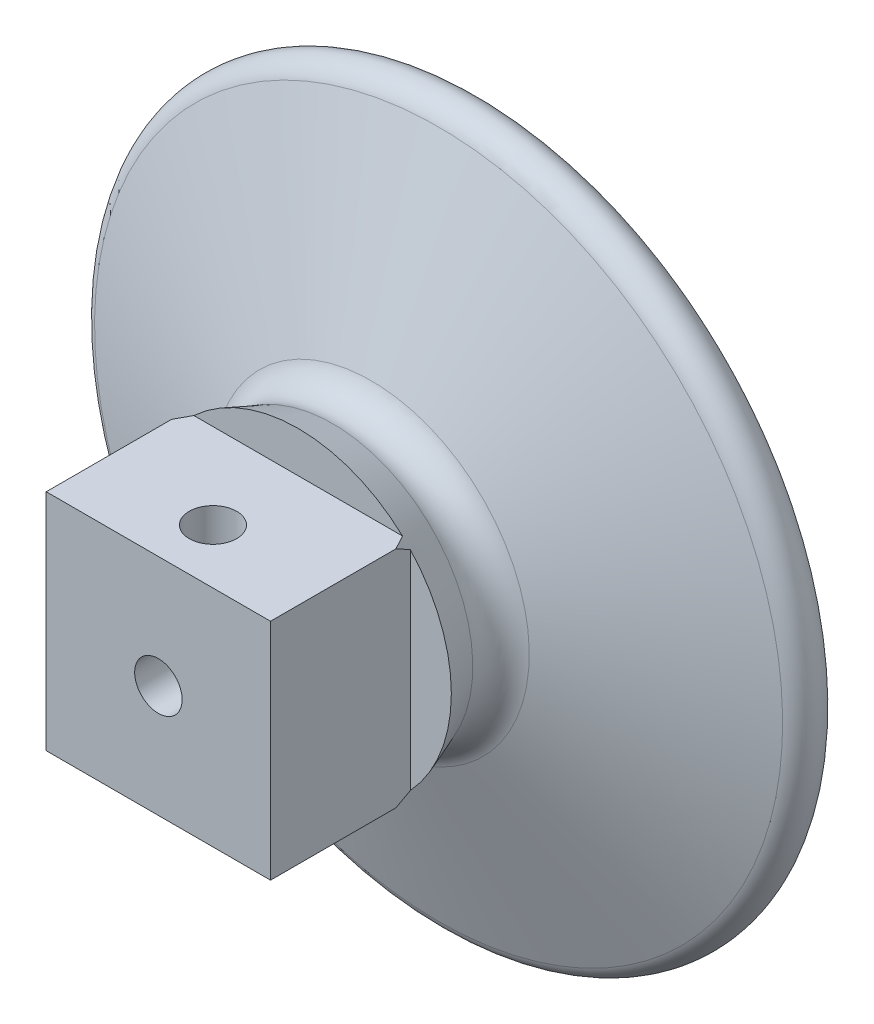
ISO-10303-21;
HEADER;
FILE_DESCRIPTION(('STEP AP214'),'2;1');
FILE_NAME('part.step','',(''),(''),'','','');
FILE_SCHEMA(('AUTOMOTIVE_DESIGN { 1 0 10303 214 1 1 1 1 }'));
ENDSEC;
DATA;
#1=APPLICATION_CONTEXT('core data for automotive mechanical design processes');
#2=APPLICATION_PROTOCOL_DEFINITION('international standard','automotive_design',2000,#1);
#3=PRODUCT_CONTEXT('',#1,'mechanical');
#4=PRODUCT('Part','Part','',(#3));
#5=PRODUCT_RELATED_PRODUCT_CATEGORY('part','',(#4));
#6=PRODUCT_DEFINITION_FORMATION('','',#4);
#7=PRODUCT_DEFINITION_CONTEXT('part definition',#1,'design');
#8=PRODUCT_DEFINITION('design','',#6,#7);
#9=PRODUCT_DEFINITION_SHAPE('','',#8);
#10=(LENGTH_UNIT() NAMED_UNIT(*) SI_UNIT(.MILLI.,.METRE.));
#11=(NAMED_UNIT(*) PLANE_ANGLE_UNIT() SI_UNIT($,.RADIAN.));
#12=(NAMED_UNIT(*) SI_UNIT($,.STERADIAN.) SOLID_ANGLE_UNIT());
#13=UNCERTAINTY_MEASURE_WITH_UNIT(LENGTH_MEASURE(1.E-05),#10,'distance_accuracy_value','');
#14=(GEOMETRIC_REPRESENTATION_CONTEXT(3) GLOBAL_UNCERTAINTY_ASSIGNED_CONTEXT((#13)) GLOBAL_UNIT_ASSIGNED_CONTEXT((#10,
#11,#12)) REPRESENTATION_CONTEXT('',''));
#15=CARTESIAN_POINT('',(0.,0.,0.));
#16=DIRECTION('',(0.,0.,1.));
#17=DIRECTION('',(1.,0.,0.));
#18=AXIS2_PLACEMENT_3D('',#15,#16,#17);
#19=CARTESIAN_POINT('',(0.,0.,-8.));
#20=DIRECTION('',(0.,0.,1.));
#21=DIRECTION('',(0.,-1.,0.));
#22=AXIS2_PLACEMENT_3D('',#19,#20,#21);
#23=CONICAL_SURFACE('',#22,9.37804492160091,0.359770803264741);
#24=CARTESIAN_POINT('',(0.,0.,-8.));
#25=DIRECTION('',(0.,0.,1.));
#26=DIRECTION('',(0.,-1.,0.));
#27=AXIS2_PLACEMENT_3D('',#24,#25,#26);
#28=CIRCLE('',#27,9.37804492160091);
#29=CARTESIAN_POINT('',(0.,-9.37804492160091,-8.));
#30=VERTEX_POINT('',#29);
#31=EDGE_CURVE('E224',#30,#30,#28,.T.);
#32=ORIENTED_EDGE('',*,*,#31,.T.);
#33=EDGE_LOOP('',(#32));
#34=FACE_BOUND('',#33,.T.);
#35=CARTESIAN_POINT('',(-7.5,7.5007,-4.73247236443383));
#36=CARTESIAN_POINT('',(-7.5,7.35811362437048,-5.00047216604525));
#37=CARTESIAN_POINT('',(-7.5,7.21398654034621,-5.26766417626513));
#38=CARTESIAN_POINT('',(-7.5,6.92200385101639,-5.80008392290339));
#39=CARTESIAN_POINT('',(-7.5,6.77414736640256,-6.06531117664168));
#40=CARTESIAN_POINT('',(-7.5,6.47252966357667,-6.59613428710672));
#41=CARTESIAN_POINT('',(-7.5,6.31872235246203,-6.86170402933926));
#42=CARTESIAN_POINT('',(-7.5,6.00587997062722,-7.38971035503824));
#43=CARTESIAN_POINT('',(-7.5,5.84684554563505,-7.65214732009066));
#44=CARTESIAN_POINT('',(-7.5,5.49732541240944,-8.21345445131997));
#45=CARTESIAN_POINT('',(-7.5,5.30578421006619,-8.511670107094));
#46=CARTESIAN_POINT('',(-7.5,4.91205806491231,-9.10099874614034));
#47=CARTESIAN_POINT('',(-7.5,4.7098748719302,-9.3921128856435));
#48=CARTESIAN_POINT('',(-7.5,4.39667523653696,-9.82054062829603));
#49=CARTESIAN_POINT('',(-7.5,4.29087114787307,-9.9616666249782));
#50=CARTESIAN_POINT('',(-7.5,4.07529306550103,-10.2408461306071));
#51=CARTESIAN_POINT('',(-7.5,3.96551942746727,-10.3788999130446));
#52=CARTESIAN_POINT('',(-7.5,3.74146253933859,-10.6511224468987));
#53=CARTESIAN_POINT('',(-7.5,3.62718301533615,-10.7852942556166));
#54=CARTESIAN_POINT('',(-7.5,3.39329082210422,-11.0488871001384));
#55=CARTESIAN_POINT('',(-7.5,3.27367938734298,-11.1783092230891));
#56=CARTESIAN_POINT('',(-7.5,3.08119708867093,-11.3765131936788));
#57=CARTESIAN_POINT('',(-7.5,3.01044276784076,-11.4473509281394));
#58=CARTESIAN_POINT('',(-7.5,2.86672039097803,-11.5867419380933));
#59=CARTESIAN_POINT('',(-7.5,2.79375229640325,-11.6552951737694));
#60=CARTESIAN_POINT('',(-7.5,2.57107184076625,-11.8571195834076));
#61=CARTESIAN_POINT('',(-7.5,2.41769852055109,-11.9864349459963));
#62=CARTESIAN_POINT('',(-7.5,2.10283920199915,-12.2278115605742));
#63=CARTESIAN_POINT('',(-7.5,1.94158910798017,-12.3401764099889));
#64=CARTESIAN_POINT('',(-7.5,1.60702225053234,-12.5449161333424));
#65=CARTESIAN_POINT('',(-7.5,1.43373207475942,-12.6373333118018));
#66=CARTESIAN_POINT('',(-7.5,1.09330367705751,-12.7865928430812));
#67=CARTESIAN_POINT('',(-7.5,0.927370824246037,-12.8461192763854));
#68=CARTESIAN_POINT('',(-7.5,0.587781906709609,-12.9368055269062));
#69=CARTESIAN_POINT('',(-7.5,0.414131398150886,-12.9679854154614));
#70=CARTESIAN_POINT('',(-7.5,0.0629699011393333,-12.9976981954961));
#71=CARTESIAN_POINT('',(-7.5,-0.11455713682984,-12.996049400716));
#72=CARTESIAN_POINT('',(-7.5,-0.466285566453067,-12.9599141384915));
#73=CARTESIAN_POINT('',(-7.5,-0.640482854630306,-12.9253895214226));
#74=CARTESIAN_POINT('',(-7.5,-1.01836905902207,-12.8174671299713));
#75=CARTESIAN_POINT('',(-7.5,-1.22002929794652,-12.7371456163215));
#76=CARTESIAN_POINT('',(-7.5,-1.60824594383761,-12.5460184094595));
#77=CARTESIAN_POINT('',(-7.5,-1.79476660566444,-12.4351431411073));
#78=CARTESIAN_POINT('',(-7.5,-2.1427493153764,-12.1996485621415));
#79=CARTESIAN_POINT('',(-7.5,-2.30504042811212,-12.0762250979694));
#80=CARTESIAN_POINT('',(-7.5,-2.61874316725789,-11.8161240235588));
#81=CARTESIAN_POINT('',(-7.5,-2.77014365923342,-11.6794331750492));
#82=CARTESIAN_POINT('',(-7.5,-3.06485571199536,-11.395425903411));
#83=CARTESIAN_POINT('',(-7.5,-3.20809340811013,-11.2480336552035));
#84=CARTESIAN_POINT('',(-7.5,-3.48667434948826,-10.9461662985553));
#85=CARTESIAN_POINT('',(-7.5,-3.6220215650345,-10.7916948233194));
#86=CARTESIAN_POINT('',(-7.5,-3.94704121898384,-10.4049446046214));
#87=CARTESIAN_POINT('',(-7.5,-4.13303620833662,-10.169585953979));
#88=CARTESIAN_POINT('',(-7.5,-4.49429038427141,-9.69072494148843));
#89=CARTESIAN_POINT('',(-7.5,-4.6695455363535,-9.44721957172711));
#90=CARTESIAN_POINT('',(-7.5,-5.01181225553217,-8.95378198380803));
#91=CARTESIAN_POINT('',(-7.5,-5.17880646398954,-8.70383778219286));
#92=CARTESIAN_POINT('',(-7.5,-5.50582658857605,-8.19942712954559));
#93=CARTESIAN_POINT('',(-7.5,-5.66585199289466,-7.94496034828735));
#94=CARTESIAN_POINT('',(-7.5,-5.97149422579674,-7.44663587776924));
#95=CARTESIAN_POINT('',(-7.5,-6.11741907872977,-7.20296645827329));
#96=CARTESIAN_POINT('',(-7.5,-6.40494834883637,-6.71307898125429));
#97=CARTESIAN_POINT('',(-7.5,-6.54655252725282,-6.46686078389097));
#98=CARTESIAN_POINT('',(-7.5,-6.82538105441513,-5.97357234665036));
#99=CARTESIAN_POINT('',(-7.5,-6.96262364656063,-5.72651239373626));
#100=CARTESIAN_POINT('',(-7.5,-7.23392400202752,-5.23069371771645));
#101=CARTESIAN_POINT('',(-7.5,-7.36798221047954,-4.98193523837368));
#102=CARTESIAN_POINT('',(-7.5,-7.50070000000013,-4.73247236443395));
#103=B_SPLINE_CURVE_WITH_KNOTS('',3,(#35,#36,#37,#38,#39,#40,#41,#42,#43,#44,#45,#46,#47,#48,
#49,#50,#51,#52,#53,#54,#55,#56,#57,#58,#59,#60,#61,#62,#63,#64,#65,#66,#67,#68,#69,#70,#71,#72,
#73,#74,#75,#76,#77,#78,#79,#80,#81,#82,#83,#84,#85,#86,#87,#88,#89,#90,#91,#92,#93,#94,#95,#96,
#97,#98,#99,#100,#101,#102),.UNSPECIFIED.,.F.,.F.,(4,2,2,2,2,2,2,2,2,2,2,2,2,2,2,2,2,2,2,2,2,2,
2,2,2,2,2,2,2,2,2,2,2,4),(0.,0.910720759354274,1.82165829118974,2.74228995235112,
3.66280830822179,4.72593748194272,5.78889239151147,6.31798655288526,6.84703342395035,
7.37565162210483,7.90414806145266,8.20446383825922,8.50478484662448,9.10592605841301,
9.694530155356,10.2818734158085,10.8087086947458,11.3351706462181,11.8645470416593,
12.3945384833943,13.0420847220465,13.6911178749675,14.3018824830244,14.9132629060778,
15.5295031498918,16.1454305928678,17.0449264871322,17.9447582381376,18.8464067934654,
19.748121457357,20.6001378339148,21.4522012072821,22.3000374487521,23.1477544691526),.UNSPECIFIED.);
#104=CARTESIAN_POINT('',(-7.5,-6.97656974205115,-5.7));
#105=VERTEX_POINT('',#104);
#106=CARTESIAN_POINT('',(-7.5,-7.5,-4.73378832314564));
#107=VERTEX_POINT('',#106);
#108=EDGE_CURVE('E165',#105,#107,#103,.T.);
#109=ORIENTED_EDGE('',*,*,#108,.F.);
#110=CARTESIAN_POINT('',(0.,0.,-5.7));
#111=DIRECTION('',(0.,0.,1.));
#112=DIRECTION('',(1.,0.,0.));
#113=AXIS2_PLACEMENT_3D('',#110,#111,#112);
#114=CIRCLE('',#113,10.2431696932982);
#115=CARTESIAN_POINT('',(-7.5,6.97656974205115,-5.7));
#116=VERTEX_POINT('',#115);
#117=EDGE_CURVE('E59',#116,#105,#114,.T.);
#118=ORIENTED_EDGE('',*,*,#117,.F.);
#119=CARTESIAN_POINT('',(-7.5,7.5,-4.73378832314564));
#120=VERTEX_POINT('',#119);
#121=EDGE_CURVE('E200',#120,#116,#103,.T.);
#122=ORIENTED_EDGE('',*,*,#121,.F.);
#123=CARTESIAN_POINT('',(7.5007,7.5,-4.73247236443384));
#124=CARTESIAN_POINT('',(7.35811362437048,7.5,-5.00047216604525));
#125=CARTESIAN_POINT('',(7.21398654034621,7.5,-5.26766417626514));
#126=CARTESIAN_POINT('',(6.92200385101639,7.5,-5.80008392290339));
#127=CARTESIAN_POINT('',(6.77414736640256,7.5,-6.06531117664169));
#128=CARTESIAN_POINT('',(6.47252966357667,7.5,-6.59613428710672));
#129=CARTESIAN_POINT('',(6.31872235246203,7.5,-6.86170402933926));
#130=CARTESIAN_POINT('',(6.00587997062722,7.5,-7.38971035503824));
#131=CARTESIAN_POINT('',(5.84684554563505,7.5,-7.65214732009066));
#132=CARTESIAN_POINT('',(5.49732541240944,7.5,-8.21345445131997));
#133=CARTESIAN_POINT('',(5.30578421006619,7.5,-8.511670107094));
#134=CARTESIAN_POINT('',(4.91205806491231,7.5,-9.10099874614034));
#135=CARTESIAN_POINT('',(4.7098748719302,7.5,-9.3921128856435));
#136=CARTESIAN_POINT('',(4.39667523653696,7.5,-9.82054062829603));
#137=CARTESIAN_POINT('',(4.29087114787307,7.5,-9.96166662497821));
#138=CARTESIAN_POINT('',(4.07529306550103,7.5,-10.2408461306071));
#139=CARTESIAN_POINT('',(3.96551942746727,7.5,-10.3788999130446));
#140=CARTESIAN_POINT('',(3.74146253933859,7.5,-10.6511224468987));
#141=CARTESIAN_POINT('',(3.62718301533615,7.5,-10.7852942556166));
#142=CARTESIAN_POINT('',(3.39329082210422,7.5,-11.0488871001384));
#143=CARTESIAN_POINT('',(3.27367938734298,7.5,-11.1783092230891));
#144=CARTESIAN_POINT('',(3.08119708867093,7.5,-11.3765131936788));
#145=CARTESIAN_POINT('',(3.01044276784075,7.5,-11.4473509281394));
#146=CARTESIAN_POINT('',(2.86672039097803,7.5,-11.5867419380933));
#147=CARTESIAN_POINT('',(2.79375229640325,7.5,-11.6552951737694));
#148=CARTESIAN_POINT('',(2.57107184076625,7.5,-11.8571195834076));
#149=CARTESIAN_POINT('',(2.41769852055109,7.5,-11.9864349459964));
#150=CARTESIAN_POINT('',(2.10283920199915,7.5,-12.2278115605742));
#151=CARTESIAN_POINT('',(1.94158910798017,7.5,-12.3401764099889));
#152=CARTESIAN_POINT('',(1.60702225053234,7.5,-12.5449161333424));
#153=CARTESIAN_POINT('',(1.43373207475942,7.5,-12.6373333118018));
#154=CARTESIAN_POINT('',(1.09330367705751,7.5,-12.7865928430812));
#155=CARTESIAN_POINT('',(0.927370824246036,7.5,-12.8461192763854));
#156=CARTESIAN_POINT('',(0.587781906709607,7.5,-12.9368055269062));
#157=CARTESIAN_POINT('',(0.414131398150886,7.5,-12.9679854154614));
#158=CARTESIAN_POINT('',(0.0629699011393335,7.5,-12.9976981954961));
#159=CARTESIAN_POINT('',(-0.11455713682984,7.5,-12.996049400716));
#160=CARTESIAN_POINT('',(-0.466285566453067,7.5,-12.9599141384915));
#161=CARTESIAN_POINT('',(-0.640482854630306,7.5,-12.9253895214227));
#162=CARTESIAN_POINT('',(-1.01836905902207,7.5,-12.8174671299713));
#163=CARTESIAN_POINT('',(-1.22002929794651,7.5,-12.7371456163215));
#164=CARTESIAN_POINT('',(-1.60824594383761,7.5,-12.5460184094595));
#165=CARTESIAN_POINT('',(-1.79476660566444,7.5,-12.4351431411073));
#166=CARTESIAN_POINT('',(-2.1427493153764,7.5,-12.1996485621415));
#167=CARTESIAN_POINT('',(-2.30504042811212,7.5,-12.0762250979694));
#168=CARTESIAN_POINT('',(-2.61874316725789,7.5,-11.8161240235588));
#169=CARTESIAN_POINT('',(-2.77014365923342,7.5,-11.6794331750492));
#170=CARTESIAN_POINT('',(-3.06485571199536,7.5,-11.395425903411));
#171=CARTESIAN_POINT('',(-3.20809340811012,7.5,-11.2480336552035));
#172=CARTESIAN_POINT('',(-3.48667434948826,7.5,-10.9461662985553));
#173=CARTESIAN_POINT('',(-3.6220215650345,7.5,-10.7916948233194));
#174=CARTESIAN_POINT('',(-3.94704121898384,7.5,-10.4049446046214));
#175=CARTESIAN_POINT('',(-4.13303620833662,7.5,-10.169585953979));
#176=CARTESIAN_POINT('',(-4.49429038427141,7.5,-9.69072494148844));
#177=CARTESIAN_POINT('',(-4.66954553635349,7.5,-9.44721957172712));
#178=CARTESIAN_POINT('',(-5.01181225553217,7.5,-8.95378198380803));
#179=CARTESIAN_POINT('',(-5.17880646398954,7.5,-8.70383778219287));
#180=CARTESIAN_POINT('',(-5.50582658857605,7.5,-8.19942712954559));
#181=CARTESIAN_POINT('',(-5.66585199289466,7.5,-7.94496034828735));
#182=CARTESIAN_POINT('',(-5.97149422579675,7.5,-7.44663587776924));
#183=CARTESIAN_POINT('',(-6.11741907872977,7.5,-7.20296645827329));
#184=CARTESIAN_POINT('',(-6.40494834883637,7.5,-6.71307898125429));
#185=CARTESIAN_POINT('',(-6.54655252725282,7.5,-6.46686078389097));
#186=CARTESIAN_POINT('',(-6.82538105441513,7.5,-5.97357234665036));
#187=CARTESIAN_POINT('',(-6.96262364656063,7.5,-5.72651239373627));
#188=CARTESIAN_POINT('',(-7.23392400202752,7.5,-5.23069371771645));
#189=CARTESIAN_POINT('',(-7.36798221047954,7.5,-4.98193523837368));
#190=CARTESIAN_POINT('',(-7.50070000000014,7.5,-4.73247236443394));
#191=B_SPLINE_CURVE_WITH_KNOTS('',3,(#123,#124,#125,#126,#127,#128,#129,#130,#131,#132,#133,
#134,#135,#136,#137,#138,#139,#140,#141,#142,#143,#144,#145,#146,#147,#148,#149,#150,#151,#152,
#153,#154,#155,#156,#157,#158,#159,#160,#161,#162,#163,#164,#165,#166,#167,#168,#169,#170,#171,
#172,#173,#174,#175,#176,#177,#178,#179,#180,#181,#182,#183,#184,#185,#186,#187,#188,#189,#190),
.UNSPECIFIED.,.F.,.F.,(4,2,2,2,2,2,2,2,2,2,2,2,2,2,2,2,2,2,2,2,2,2,2,2,2,2,2,2,2,2,2,2,2,4),(0.,
0.910720759354271,1.82165829118974,2.74228995235112,3.66280830822178,4.72593748194271,
5.78889239151146,6.31798655288526,6.84703342395034,7.37565162210483,7.90414806145265,
8.20446383825921,8.50478484662448,9.105926058413,9.69453015535599,10.2818734158085,
10.8087086947458,11.3351706462181,11.8645470416593,12.3945384833942,13.0420847220465,
13.6911178749675,14.3018824830244,14.9132629060778,15.5295031498918,16.1454305928677,
17.0449264871322,17.9447582381376,18.8464067934654,19.748121457357,20.6001378339148,
21.4522012072821,22.3000374487521,23.1477544691526),.UNSPECIFIED.);
#192=CARTESIAN_POINT('',(-6.97656974205115,7.5,-5.7));
#193=VERTEX_POINT('',#192);
#194=EDGE_CURVE('E140',#193,#120,#191,.T.);
#195=ORIENTED_EDGE('',*,*,#194,.F.);
#196=CARTESIAN_POINT('',(6.97656974205115,7.5,-5.7));
#197=VERTEX_POINT('',#196);
#198=EDGE_CURVE('E243',#197,#193,#114,.T.);
#199=ORIENTED_EDGE('',*,*,#198,.F.);
#200=CARTESIAN_POINT('',(7.5,7.5,-4.73378832314564));
#201=VERTEX_POINT('',#200);
#202=EDGE_CURVE('E164',#201,#197,#191,.T.);
#203=ORIENTED_EDGE('',*,*,#202,.F.);
#204=CARTESIAN_POINT('',(7.5,7.5007,-4.73247236443384));
#205=CARTESIAN_POINT('',(7.5,7.35811362437048,-5.00047216604525));
#206=CARTESIAN_POINT('',(7.5,7.21398654034621,-5.26766417626514));
#207=CARTESIAN_POINT('',(7.5,6.92200385101639,-5.80008392290339));
#208=CARTESIAN_POINT('',(7.5,6.77414736640256,-6.06531117664169));
#209=CARTESIAN_POINT('',(7.5,6.47252966357667,-6.59613428710672));
#210=CARTESIAN_POINT('',(7.5,6.31872235246204,-6.86170402933926));
#211=CARTESIAN_POINT('',(7.5,6.00587997062722,-7.38971035503824));
#212=CARTESIAN_POINT('',(7.5,5.84684554563505,-7.65214732009066));
#213=CARTESIAN_POINT('',(7.5,5.49732541240944,-8.21345445131998));
#214=CARTESIAN_POINT('',(7.5,5.30578421006618,-8.51167010709401));
#215=CARTESIAN_POINT('',(7.5,4.91205806491231,-9.10099874614034));
#216=CARTESIAN_POINT('',(7.5,4.7098748719302,-9.3921128856435));
#217=CARTESIAN_POINT('',(7.5,4.39667523653696,-9.82054062829604));
#218=CARTESIAN_POINT('',(7.5,4.29087114787307,-9.96166662497821));
#219=CARTESIAN_POINT('',(7.5,4.07529306550103,-10.2408461306071));
#220=CARTESIAN_POINT('',(7.5,3.96551942746727,-10.3788999130446));
#221=CARTESIAN_POINT('',(7.5,3.74146253933859,-10.6511224468987));
#222=CARTESIAN_POINT('',(7.5,3.62718301533616,-10.7852942556166));
#223=CARTESIAN_POINT('',(7.5,3.39329082210422,-11.0488871001384));
#224=CARTESIAN_POINT('',(7.5,3.27367938734298,-11.1783092230891));
#225=CARTESIAN_POINT('',(7.5,3.08119708867093,-11.3765131936788));
#226=CARTESIAN_POINT('',(7.5,3.01044276784076,-11.4473509281394));
#227=CARTESIAN_POINT('',(7.5,2.86672039097803,-11.5867419380933));
#228=CARTESIAN_POINT('',(7.5,2.79375229640325,-11.6552951737694));
#229=CARTESIAN_POINT('',(7.5,2.57107184076625,-11.8571195834076));
#230=CARTESIAN_POINT('',(7.5,2.41769852055109,-11.9864349459964));
#231=CARTESIAN_POINT('',(7.5,2.10283920199915,-12.2278115605742));
#232=CARTESIAN_POINT('',(7.5,1.94158910798017,-12.3401764099889));
#233=CARTESIAN_POINT('',(7.5,1.60702225053235,-12.5449161333424));
#234=CARTESIAN_POINT('',(7.5,1.43373207475942,-12.6373333118018));
#235=CARTESIAN_POINT('',(7.5,1.09330367705752,-12.7865928430812));
#236=CARTESIAN_POINT('',(7.5,0.927370824246038,-12.8461192763854));
#237=CARTESIAN_POINT('',(7.5,0.587781906709609,-12.9368055269062));
#238=CARTESIAN_POINT('',(7.5,0.414131398150887,-12.9679854154614));
#239=CARTESIAN_POINT('',(7.5,0.0629699011393348,-12.9976981954961));
#240=CARTESIAN_POINT('',(7.5,-0.114557136829839,-12.996049400716));
#241=CARTESIAN_POINT('',(7.5,-0.466285566453066,-12.9599141384915));
#242=CARTESIAN_POINT('',(7.5,-0.640482854630305,-12.9253895214227));
#243=CARTESIAN_POINT('',(7.5,-1.01836905902207,-12.8174671299713));
#244=CARTESIAN_POINT('',(7.5,-1.22002929794651,-12.7371456163215));
#245=CARTESIAN_POINT('',(7.5,-1.60824594383761,-12.5460184094595));
#246=CARTESIAN_POINT('',(7.5,-1.79476660566444,-12.4351431411073));
#247=CARTESIAN_POINT('',(7.5,-2.1427493153764,-12.1996485621415));
#248=CARTESIAN_POINT('',(7.5,-2.30504042811212,-12.0762250979694));
#249=CARTESIAN_POINT('',(7.5,-2.61874316725789,-11.8161240235588));
#250=CARTESIAN_POINT('',(7.5,-2.77014365923341,-11.6794331750492));
#251=CARTESIAN_POINT('',(7.5,-3.06485571199535,-11.395425903411));
#252=CARTESIAN_POINT('',(7.5,-3.20809340811012,-11.2480336552035));
#253=CARTESIAN_POINT('',(7.5,-3.48667434948826,-10.9461662985553));
#254=CARTESIAN_POINT('',(7.5,-3.62202156503449,-10.7916948233194));
#255=CARTESIAN_POINT('',(7.5,-3.94704121898384,-10.4049446046214));
#256=CARTESIAN_POINT('',(7.5,-4.13303620833662,-10.169585953979));
#257=CARTESIAN_POINT('',(7.5,-4.4942903842714,-9.69072494148844));
#258=CARTESIAN_POINT('',(7.5,-4.66954553635349,-9.44721957172712));
#259=CARTESIAN_POINT('',(7.5,-5.01181225553217,-8.95378198380804));
#260=CARTESIAN_POINT('',(7.5,-5.17880646398954,-8.70383778219287));
#261=CARTESIAN_POINT('',(7.5,-5.50582658857605,-8.1994271295456));
#262=CARTESIAN_POINT('',(7.5,-5.66585199289466,-7.94496034828735));
#263=CARTESIAN_POINT('',(7.5,-5.97149422579675,-7.44663587776924));
#264=CARTESIAN_POINT('',(7.5,-6.11741907872977,-7.20296645827329));
#265=CARTESIAN_POINT('',(7.5,-6.40494834883637,-6.71307898125429));
#266=CARTESIAN_POINT('',(7.5,-6.54655252725282,-6.46686078389098));
#267=CARTESIAN_POINT('',(7.5,-6.82538105441513,-5.97357234665036));
#268=CARTESIAN_POINT('',(7.5,-6.96262364656063,-5.72651239373627));
#269=CARTESIAN_POINT('',(7.5,-7.23392400202752,-5.23069371771645));
#270=CARTESIAN_POINT('',(7.5,-7.36798221047954,-4.98193523837369));
#271=CARTESIAN_POINT('',(7.5,-7.50070000000014,-4.73247236443395));
#272=B_SPLINE_CURVE_WITH_KNOTS('',3,(#204,#205,#206,#207,#208,#209,#210,#211,#212,#213,#214,
#215,#216,#217,#218,#219,#220,#221,#222,#223,#224,#225,#226,#227,#228,#229,#230,#231,#232,#233,
#234,#235,#236,#237,#238,#239,#240,#241,#242,#243,#244,#245,#246,#247,#248,#249,#250,#251,#252,
#253,#254,#255,#256,#257,#258,#259,#260,#261,#262,#263,#264,#265,#266,#267,#268,#269,#270,#271),
.UNSPECIFIED.,.F.,.F.,(4,2,2,2,2,2,2,2,2,2,2,2,2,2,2,2,2,2,2,2,2,2,2,2,2,2,2,2,2,2,2,2,2,4),(0.,
0.910720759354274,1.82165829118974,2.74228995235112,3.66280830822179,4.72593748194272,
5.78889239151147,6.31798655288526,6.84703342395035,7.37565162210483,7.90414806145266,
8.20446383825922,8.50478484662448,9.10592605841301,9.694530155356,10.2818734158085,
10.8087086947458,11.3351706462181,11.8645470416593,12.3945384833942,13.0420847220465,
13.6911178749675,14.3018824830244,14.9132629060778,15.5295031498918,16.1454305928677,
17.0449264871322,17.9447582381376,18.8464067934654,19.748121457357,20.6001378339148,
21.4522012072821,22.3000374487521,23.1477544691526),.UNSPECIFIED.);
#273=CARTESIAN_POINT('',(7.5,6.97656974205115,-5.7));
#274=VERTEX_POINT('',#273);
#275=EDGE_CURVE('E209',#201,#274,#272,.T.);
#276=ORIENTED_EDGE('',*,*,#275,.T.);
#277=CARTESIAN_POINT('',(7.5,-6.97656974205115,-5.7));
#278=VERTEX_POINT('',#277);
#279=EDGE_CURVE('E236',#278,#274,#114,.T.);
#280=ORIENTED_EDGE('',*,*,#279,.F.);
#281=CARTESIAN_POINT('',(7.5,-7.5,-4.73378832314564));
#282=VERTEX_POINT('',#281);
#283=EDGE_CURVE('E201',#278,#282,#272,.T.);
#284=ORIENTED_EDGE('',*,*,#283,.T.);
#285=CARTESIAN_POINT('',(7.5007,-7.5,-4.73247236443384));
#286=CARTESIAN_POINT('',(7.35811362437048,-7.5,-5.00047216604525));
#287=CARTESIAN_POINT('',(7.21398654034621,-7.5,-5.26766417626514));
#288=CARTESIAN_POINT('',(6.92200385101639,-7.5,-5.80008392290339));
#289=CARTESIAN_POINT('',(6.77414736640256,-7.5,-6.06531117664169));
#290=CARTESIAN_POINT('',(6.47252966357667,-7.5,-6.59613428710672));
#291=CARTESIAN_POINT('',(6.31872235246203,-7.5,-6.86170402933926));
#292=CARTESIAN_POINT('',(6.00587997062722,-7.5,-7.38971035503824));
#293=CARTESIAN_POINT('',(5.84684554563505,-7.5,-7.65214732009066));
#294=CARTESIAN_POINT('',(5.49732541240944,-7.5,-8.21345445131997));
#295=CARTESIAN_POINT('',(5.30578421006619,-7.5,-8.511670107094));
#296=CARTESIAN_POINT('',(4.91205806491231,-7.5,-9.10099874614034));
#297=CARTESIAN_POINT('',(4.7098748719302,-7.5,-9.3921128856435));
#298=CARTESIAN_POINT('',(4.39667523653696,-7.5,-9.82054062829603));
#299=CARTESIAN_POINT('',(4.29087114787307,-7.5,-9.96166662497821));
#300=CARTESIAN_POINT('',(4.07529306550103,-7.5,-10.2408461306071));
#301=CARTESIAN_POINT('',(3.96551942746727,-7.5,-10.3788999130446));
#302=CARTESIAN_POINT('',(3.74146253933859,-7.5,-10.6511224468987));
#303=CARTESIAN_POINT('',(3.62718301533615,-7.5,-10.7852942556166));
#304=CARTESIAN_POINT('',(3.39329082210422,-7.5,-11.0488871001384));
#305=CARTESIAN_POINT('',(3.27367938734298,-7.5,-11.1783092230891));
#306=CARTESIAN_POINT('',(3.08119708867093,-7.5,-11.3765131936788));
#307=CARTESIAN_POINT('',(3.01044276784075,-7.5,-11.4473509281394));
#308=CARTESIAN_POINT('',(2.86672039097803,-7.5,-11.5867419380933));
#309=CARTESIAN_POINT('',(2.79375229640325,-7.5,-11.6552951737694));
#310=CARTESIAN_POINT('',(2.57107184076625,-7.5,-11.8571195834076));
#311=CARTESIAN_POINT('',(2.41769852055109,-7.5,-11.9864349459964));
#312=CARTESIAN_POINT('',(2.10283920199915,-7.5,-12.2278115605742));
#313=CARTESIAN_POINT('',(1.94158910798017,-7.5,-12.3401764099889));
#314=CARTESIAN_POINT('',(1.60702225053234,-7.5,-12.5449161333424));
#315=CARTESIAN_POINT('',(1.43373207475942,-7.5,-12.6373333118018));
#316=CARTESIAN_POINT('',(1.09330367705751,-7.5,-12.7865928430812));
#317=CARTESIAN_POINT('',(0.927370824246036,-7.5,-12.8461192763854));
#318=CARTESIAN_POINT('',(0.587781906709607,-7.5,-12.9368055269062));
#319=CARTESIAN_POINT('',(0.414131398150886,-7.5,-12.9679854154614));
#320=CARTESIAN_POINT('',(0.0629699011393335,-7.5,-12.9976981954961));
#321=CARTESIAN_POINT('',(-0.11455713682984,-7.5,-12.996049400716));
#322=CARTESIAN_POINT('',(-0.466285566453067,-7.5,-12.9599141384915));
#323=CARTESIAN_POINT('',(-0.640482854630306,-7.5,-12.9253895214227));
#324=CARTESIAN_POINT('',(-1.01836905902207,-7.5,-12.8174671299713));
#325=CARTESIAN_POINT('',(-1.22002929794651,-7.5,-12.7371456163215));
#326=CARTESIAN_POINT('',(-1.60824594383761,-7.5,-12.5460184094595));
#327=CARTESIAN_POINT('',(-1.79476660566444,-7.5,-12.4351431411073));
#328=CARTESIAN_POINT('',(-2.1427493153764,-7.5,-12.1996485621415));
#329=CARTESIAN_POINT('',(-2.30504042811212,-7.5,-12.0762250979694));
#330=CARTESIAN_POINT('',(-2.61874316725789,-7.5,-11.8161240235588));
#331=CARTESIAN_POINT('',(-2.77014365923342,-7.5,-11.6794331750492));
#332=CARTESIAN_POINT('',(-3.06485571199536,-7.5,-11.395425903411));
#333=CARTESIAN_POINT('',(-3.20809340811012,-7.5,-11.2480336552035));
#334=CARTESIAN_POINT('',(-3.48667434948826,-7.5,-10.9461662985553));
#335=CARTESIAN_POINT('',(-3.6220215650345,-7.5,-10.7916948233194));
#336=CARTESIAN_POINT('',(-3.94704121898384,-7.5,-10.4049446046214));
#337=CARTESIAN_POINT('',(-4.13303620833662,-7.5,-10.169585953979));
#338=CARTESIAN_POINT('',(-4.49429038427141,-7.5,-9.69072494148844));
#339=CARTESIAN_POINT('',(-4.66954553635349,-7.5,-9.44721957172712));
#340=CARTESIAN_POINT('',(-5.01181225553217,-7.5,-8.95378198380803));
#341=CARTESIAN_POINT('',(-5.17880646398954,-7.5,-8.70383778219287));
#342=CARTESIAN_POINT('',(-5.50582658857605,-7.5,-8.19942712954559));
#343=CARTESIAN_POINT('',(-5.66585199289466,-7.5,-7.94496034828735));
#344=CARTESIAN_POINT('',(-5.97149422579675,-7.5,-7.44663587776924));
#345=CARTESIAN_POINT('',(-6.11741907872977,-7.5,-7.20296645827329));
#346=CARTESIAN_POINT('',(-6.40494834883637,-7.5,-6.71307898125429));
#347=CARTESIAN_POINT('',(-6.54655252725282,-7.5,-6.46686078389097));
#348=CARTESIAN_POINT('',(-6.82538105441513,-7.5,-5.97357234665036));
#349=CARTESIAN_POINT('',(-6.96262364656063,-7.5,-5.72651239373627));
#350=CARTESIAN_POINT('',(-7.23392400202752,-7.5,-5.23069371771645));
#351=CARTESIAN_POINT('',(-7.36798221047954,-7.5,-4.98193523837368));
#352=CARTESIAN_POINT('',(-7.50070000000014,-7.5,-4.73247236443394));
#353=B_SPLINE_CURVE_WITH_KNOTS('',3,(#285,#286,#287,#288,#289,#290,#291,#292,#293,#294,#295,
#296,#297,#298,#299,#300,#301,#302,#303,#304,#305,#306,#307,#308,#309,#310,#311,#312,#313,#314,
#315,#316,#317,#318,#319,#320,#321,#322,#323,#324,#325,#326,#327,#328,#329,#330,#331,#332,#333,
#334,#335,#336,#337,#338,#339,#340,#341,#342,#343,#344,#345,#346,#347,#348,#349,#350,#351,#352),
.UNSPECIFIED.,.F.,.F.,(4,2,2,2,2,2,2,2,2,2,2,2,2,2,2,2,2,2,2,2,2,2,2,2,2,2,2,2,2,2,2,2,2,4),(0.,
0.910720759354271,1.82165829118974,2.74228995235112,3.66280830822178,4.72593748194271,
5.78889239151146,6.31798655288526,6.84703342395034,7.37565162210483,7.90414806145265,
8.20446383825921,8.50478484662448,9.105926058413,9.69453015535599,10.2818734158085,
10.8087086947458,11.3351706462181,11.8645470416593,12.3945384833942,13.0420847220465,
13.6911178749675,14.3018824830244,14.9132629060778,15.5295031498918,16.1454305928677,
17.0449264871322,17.9447582381376,18.8464067934654,19.748121457357,20.6001378339148,
21.4522012072821,22.3000374487521,23.1477544691526),.UNSPECIFIED.);
#354=CARTESIAN_POINT('',(6.97656974205115,-7.5,-5.7));
#355=VERTEX_POINT('',#354);
#356=EDGE_CURVE('E199',#282,#355,#353,.T.);
#357=ORIENTED_EDGE('',*,*,#356,.T.);
#358=CARTESIAN_POINT('',(-6.97656974205115,-7.5,-5.7));
#359=VERTEX_POINT('',#358);
#360=EDGE_CURVE('E240',#359,#355,#114,.T.);
#361=ORIENTED_EDGE('',*,*,#360,.F.);
#362=EDGE_CURVE('E191',#359,#107,#353,.T.);
#363=ORIENTED_EDGE('',*,*,#362,.T.);
#364=EDGE_LOOP('',(#109,#118,#122,#195,#199,#203,#276,#280,#284,#357,#361,#363));
#365=FACE_BOUND('',#364,.T.);
#366=ADVANCED_FACE('F50',(#34,#365),#23,.T.);
#367=CARTESIAN_POINT('',(0.,-24.001,0.));
#368=DIRECTION('',(0.,1.,0.));
#369=DIRECTION('',(0.,0.,1.));
#370=AXIS2_PLACEMENT_3D('',#367,#368,#369);
#371=CYLINDRICAL_SURFACE('',#370,1.5875);
#372=CARTESIAN_POINT('',(0.,0.,0.));
#373=DIRECTION('',(0.,0.707106781186547,-0.707106781186547));
#374=DIRECTION('',(0.,0.707106781186547,0.707106781186547));
#375=AXIS2_PLACEMENT_3D('',#372,#373,#374);
#376=ELLIPSE('',#375,2.24506403026729,1.5875);
#377=CARTESIAN_POINT('',(1.5875,0.,0.));
#378=VERTEX_POINT('',#377);
#379=CARTESIAN_POINT('',(-1.5875,0.,0.));
#380=VERTEX_POINT('',#379);
#381=EDGE_CURVE('E213',#378,#380,#376,.F.);
#382=ORIENTED_EDGE('',*,*,#381,.T.);
#383=CARTESIAN_POINT('',(0.,0.,0.));
#384=DIRECTION('',(0.,0.707106781186547,0.707106781186547));
#385=DIRECTION('',(0.,0.707106781186547,-0.707106781186547));
#386=AXIS2_PLACEMENT_3D('',#383,#384,#385);
#387=ELLIPSE('',#386,2.24506403026729,1.5875);
#388=EDGE_CURVE('E210',#380,#378,#387,.F.);
#389=ORIENTED_EDGE('',*,*,#388,.T.);
#390=EDGE_LOOP('',(#382,#389));
#391=FACE_BOUND('',#390,.T.);
#392=CARTESIAN_POINT('',(0.,7.5,0.));
#393=DIRECTION('',(0.,1.,0.));
#394=DIRECTION('',(0.,0.,1.));
#395=AXIS2_PLACEMENT_3D('',#392,#393,#394);
#396=CIRCLE('',#395,1.5875);
#397=CARTESIAN_POINT('',(0.,7.5,1.5875));
#398=VERTEX_POINT('',#397);
#399=EDGE_CURVE('E155',#398,#398,#396,.F.);
#400=ORIENTED_EDGE('',*,*,#399,.F.);
#401=EDGE_LOOP('',(#400));
#402=FACE_BOUND('',#401,.T.);
#403=ADVANCED_FACE('F296',(#391,#402),#371,.F.);
#404=CARTESIAN_POINT('',(0.,0.,-16.5));
#405=DIRECTION('',(0.,0.,1.));
#406=DIRECTION('',(0.,-1.,0.));
#407=AXIS2_PLACEMENT_3D('',#404,#405,#406);
#408=TOROIDAL_SURFACE('',#407,22.5,1.5);
#409=CARTESIAN_POINT('',(0.,0.,-15.0896104131182));
#410=DIRECTION('',(0.,0.,1.));
#411=DIRECTION('',(0.,-1.,0.));
#412=AXIS2_PLACEMENT_3D('',#409,#410,#411);
#413=CIRCLE('',#412,23.0106870012204);
#414=CARTESIAN_POINT('',(0.,-23.0106870012204,-15.0896104131182));
#415=VERTEX_POINT('',#414);
#416=EDGE_CURVE('E232',#415,#415,#413,.T.);
#417=ORIENTED_EDGE('',*,*,#416,.F.);
#418=EDGE_LOOP('',(#417));
#419=FACE_BOUND('',#418,.T.);
#420=CARTESIAN_POINT('',(0.,0.,-17.5));
#421=DIRECTION('',(0.,0.,1.));
#422=DIRECTION('',(0.,-1.,0.));
#423=AXIS2_PLACEMENT_3D('',#420,#421,#422);
#424=CIRCLE('',#423,21.3819660112501);
#425=CARTESIAN_POINT('',(0.,-21.3819660112501,-17.5));
#426=VERTEX_POINT('',#425);
#427=EDGE_CURVE('E220',#426,#426,#424,.T.);
#428=ORIENTED_EDGE('',*,*,#427,.T.);
#429=EDGE_LOOP('',(#428));
#430=FACE_BOUND('',#429,.T.);
#431=ADVANCED_FACE('F52',(#419,#430),#408,.T.);
#432=CARTESIAN_POINT('',(0.,0.,-15.0896104131182));
#433=DIRECTION('',(0.,0.,-1.));
#434=DIRECTION('',(0.,1.,0.));
#435=AXIS2_PLACEMENT_3D('',#432,#433,#434);
#436=CONICAL_SURFACE('',#435,23.0106870012204,1.22339237187582);
#437=CARTESIAN_POINT('',(0.,0.,-10.5846388882312));
#438=DIRECTION('',(0.,0.,1.));
#439=DIRECTION('',(0.,-1.,0.));
#440=AXIS2_PLACEMENT_3D('',#437,#438,#439);
#441=CIRCLE('',#440,10.5690839983727);
#442=CARTESIAN_POINT('',(0.,-10.5690839983727,-10.5846388882312));
#443=VERTEX_POINT('',#442);
#444=EDGE_CURVE('E228',#443,#443,#441,.T.);
#445=ORIENTED_EDGE('',*,*,#444,.F.);
#446=EDGE_LOOP('',(#445));
#447=FACE_BOUND('',#446,.T.);
#448=ORIENTED_EDGE('',*,*,#416,.T.);
#449=EDGE_LOOP('',(#448));
#450=FACE_BOUND('',#449,.T.);
#451=ADVANCED_FACE('F309',(#447,#450),#436,.T.);
#452=CARTESIAN_POINT('',(0.,0.,-8.70411943905551));
#453=DIRECTION('',(0.,0.,1.));
#454=DIRECTION('',(0.,-1.,0.));
#455=AXIS2_PLACEMENT_3D('',#452,#453,#454);
#456=TOROIDAL_SURFACE('',#455,11.25,2.);
#457=ORIENTED_EDGE('',*,*,#31,.F.);
#458=EDGE_LOOP('',(#457));
#459=FACE_BOUND('',#458,.T.);
#460=ORIENTED_EDGE('',*,*,#444,.T.);
#461=EDGE_LOOP('',(#460));
#462=FACE_BOUND('',#461,.T.);
#463=ADVANCED_FACE('F305',(#459,#462),#456,.F.);
#464=CARTESIAN_POINT('',(0.,21.3819660112501,-17.5));
#465=DIRECTION('',(0.,0.,1.));
#466=DIRECTION('',(0.,-1.,0.));
#467=AXIS2_PLACEMENT_3D('',#464,#465,#466);
#468=PLANE('',#467);
#469=CARTESIAN_POINT('',(0.,0.,-17.5));
#470=DIRECTION('',(0.,0.,1.));
#471=DIRECTION('',(0.,-1.,0.));
#472=AXIS2_PLACEMENT_3D('',#469,#470,#471);
#473=CIRCLE('',#472,1.5875);
#474=CARTESIAN_POINT('',(0.,-1.5875,-17.5));
#475=VERTEX_POINT('',#474);
#476=EDGE_CURVE('E216',#475,#475,#473,.T.);
#477=ORIENTED_EDGE('',*,*,#476,.T.);
#478=EDGE_LOOP('',(#477));
#479=FACE_BOUND('',#478,.T.);
#480=ORIENTED_EDGE('',*,*,#427,.F.);
#481=EDGE_LOOP('',(#480));
#482=FACE_BOUND('',#481,.T.);
#483=ADVANCED_FACE('F308',(#479,#482),#468,.F.);
#484=CARTESIAN_POINT('',(0.,0.,15.9565375435138));
#485=DIRECTION('',(0.,0.,-1.));
#486=DIRECTION('',(-1.,0.,0.));
#487=AXIS2_PLACEMENT_3D('',#484,#485,#486);
#488=CYLINDRICAL_SURFACE('',#487,1.5875);
#489=CARTESIAN_POINT('',(0.,0.,3.65));
#490=DIRECTION('',(0.,0.,-1.));
#491=DIRECTION('',(-1.,0.,0.));
#492=AXIS2_PLACEMENT_3D('',#489,#490,#491);
#493=CIRCLE('',#492,1.5875);
#494=CARTESIAN_POINT('',(-1.5875,0.,3.65));
#495=VERTEX_POINT('',#494);
#496=EDGE_CURVE('E275',#495,#495,#493,.F.);
#497=ORIENTED_EDGE('',*,*,#496,.T.);
#498=EDGE_LOOP('',(#497));
#499=FACE_BOUND('',#498,.T.);
#500=ORIENTED_EDGE('',*,*,#388,.F.);
#501=ORIENTED_EDGE('',*,*,#381,.F.);
#502=EDGE_LOOP('',(#500,#501));
#503=FACE_BOUND('',#502,.T.);
#504=ORIENTED_EDGE('',*,*,#476,.F.);
#505=EDGE_LOOP('',(#504));
#506=FACE_BOUND('',#505,.T.);
#507=ADVANCED_FACE('F321',(#499,#503,#506),#488,.F.);
#508=CARTESIAN_POINT('',(0.,0.,-5.7));
#509=DIRECTION('',(0.,0.,1.));
#510=DIRECTION('',(1.,0.,0.));
#511=AXIS2_PLACEMENT_3D('',#508,#509,#510);
#512=PLANE('',#511);
#513=ORIENTED_EDGE('',*,*,#198,.T.);
#514=DIRECTION('',(1.,0.,0.));
#515=VECTOR('',#514,1.);
#516=CARTESIAN_POINT('',(0.,7.5,-5.7));
#517=LINE('',#516,#515);
#518=EDGE_CURVE('E149',#193,#197,#517,.T.);
#519=ORIENTED_EDGE('',*,*,#518,.T.);
#520=EDGE_LOOP('',(#513,#519));
#521=FACE_BOUND('',#520,.T.);
#522=ADVANCED_FACE('F178',(#521),#512,.T.);
#523=ORIENTED_EDGE('',*,*,#117,.T.);
#524=DIRECTION('',(0.,1.,0.));
#525=VECTOR('',#524,1.);
#526=CARTESIAN_POINT('',(-7.5,0.,-5.7));
#527=LINE('',#526,#525);
#528=EDGE_CURVE('E256',#105,#116,#527,.T.);
#529=ORIENTED_EDGE('',*,*,#528,.T.);
#530=EDGE_LOOP('',(#523,#529));
#531=FACE_BOUND('',#530,.T.);
#532=ADVANCED_FACE('F332',(#531),#512,.T.);
#533=ORIENTED_EDGE('',*,*,#360,.T.);
#534=DIRECTION('',(1.,0.,0.));
#535=VECTOR('',#534,1.);
#536=CARTESIAN_POINT('',(0.,-7.5,-5.7));
#537=LINE('',#536,#535);
#538=EDGE_CURVE('E267',#359,#355,#537,.T.);
#539=ORIENTED_EDGE('',*,*,#538,.F.);
#540=EDGE_LOOP('',(#533,#539));
#541=FACE_BOUND('',#540,.T.);
#542=ADVANCED_FACE('F269',(#541),#512,.T.);
#543=ORIENTED_EDGE('',*,*,#279,.T.);
#544=DIRECTION('',(0.,1.,0.));
#545=VECTOR('',#544,1.);
#546=CARTESIAN_POINT('',(7.5,0.,-5.7));
#547=LINE('',#546,#545);
#548=EDGE_CURVE('E72',#278,#274,#547,.T.);
#549=ORIENTED_EDGE('',*,*,#548,.F.);
#550=EDGE_LOOP('',(#543,#549));
#551=FACE_BOUND('',#550,.T.);
#552=ADVANCED_FACE('F290',(#551),#512,.T.);
#553=CARTESIAN_POINT('',(7.5,0.,24.3));
#554=DIRECTION('',(-1.,0.,0.));
#555=DIRECTION('',(0.,0.,1.));
#556=AXIS2_PLACEMENT_3D('',#553,#554,#555);
#557=PLANE('',#556);
#558=DIRECTION('',(0.,0.,-1.));
#559=VECTOR('',#558,1.);
#560=CARTESIAN_POINT('',(7.5,7.5,24.3));
#561=LINE('',#560,#559);
#562=CARTESIAN_POINT('',(7.5,7.5,3.65));
#563=VERTEX_POINT('',#562);
#564=EDGE_CURVE('E143',#563,#201,#561,.T.);
#565=ORIENTED_EDGE('',*,*,#564,.F.);
#566=DIRECTION('',(0.,-1.,0.));
#567=VECTOR('',#566,1.);
#568=CARTESIAN_POINT('',(7.5,0.,3.65));
#569=LINE('',#568,#567);
#570=CARTESIAN_POINT('',(7.5,-7.5,3.65));
#571=VERTEX_POINT('',#570);
#572=EDGE_CURVE('E65',#563,#571,#569,.T.);
#573=ORIENTED_EDGE('',*,*,#572,.T.);
#574=DIRECTION('',(0.,0.,-1.));
#575=VECTOR('',#574,1.);
#576=CARTESIAN_POINT('',(7.5,-7.5,24.3));
#577=LINE('',#576,#575);
#578=EDGE_CURVE('E147',#571,#282,#577,.T.);
#579=ORIENTED_EDGE('',*,*,#578,.T.);
#580=ORIENTED_EDGE('',*,*,#283,.F.);
#581=ORIENTED_EDGE('',*,*,#548,.T.);
#582=ORIENTED_EDGE('',*,*,#275,.F.);
#583=EDGE_LOOP('',(#565,#573,#579,#580,#581,#582));
#584=FACE_BOUND('',#583,.T.);
#585=ADVANCED_FACE('F187',(#584),#557,.F.);
#586=CARTESIAN_POINT('',(0.,-7.5,24.3));
#587=DIRECTION('',(0.,1.,0.));
#588=DIRECTION('',(0.,0.,1.));
#589=AXIS2_PLACEMENT_3D('',#586,#587,#588);
#590=PLANE('',#589);
#591=ORIENTED_EDGE('',*,*,#578,.F.);
#592=DIRECTION('',(-1.,0.,0.));
#593=VECTOR('',#592,1.);
#594=CARTESIAN_POINT('',(0.,-7.5,3.65));
#595=LINE('',#594,#593);
#596=CARTESIAN_POINT('',(-7.5,-7.5,3.65));
#597=VERTEX_POINT('',#596);
#598=EDGE_CURVE('E134',#571,#597,#595,.T.);
#599=ORIENTED_EDGE('',*,*,#598,.T.);
#600=DIRECTION('',(0.,0.,-1.));
#601=VECTOR('',#600,1.);
#602=CARTESIAN_POINT('',(-7.5,-7.5,24.3));
#603=LINE('',#602,#601);
#604=EDGE_CURVE('E132',#597,#107,#603,.T.);
#605=ORIENTED_EDGE('',*,*,#604,.T.);
#606=ORIENTED_EDGE('',*,*,#362,.F.);
#607=ORIENTED_EDGE('',*,*,#538,.T.);
#608=ORIENTED_EDGE('',*,*,#356,.F.);
#609=EDGE_LOOP('',(#591,#599,#605,#606,#607,#608));
#610=FACE_BOUND('',#609,.T.);
#611=ADVANCED_FACE('F183',(#610),#590,.F.);
#612=CARTESIAN_POINT('',(-7.5,0.,24.3));
#613=DIRECTION('',(-1.,0.,0.));
#614=DIRECTION('',(0.,0.,1.));
#615=AXIS2_PLACEMENT_3D('',#612,#613,#614);
#616=PLANE('',#615);
#617=DIRECTION('',(0.,-1.,0.));
#618=VECTOR('',#617,1.);
#619=CARTESIAN_POINT('',(-7.5,0.,3.65));
#620=LINE('',#619,#618);
#621=CARTESIAN_POINT('',(-7.5,7.5,3.65));
#622=VERTEX_POINT('',#621);
#623=EDGE_CURVE('E121',#622,#597,#620,.T.);
#624=ORIENTED_EDGE('',*,*,#623,.F.);
#625=DIRECTION('',(0.,0.,-1.));
#626=VECTOR('',#625,1.);
#627=CARTESIAN_POINT('',(-7.5,7.5,24.3));
#628=LINE('',#627,#626);
#629=EDGE_CURVE('E129',#622,#120,#628,.T.);
#630=ORIENTED_EDGE('',*,*,#629,.T.);
#631=ORIENTED_EDGE('',*,*,#121,.T.);
#632=ORIENTED_EDGE('',*,*,#528,.F.);
#633=ORIENTED_EDGE('',*,*,#108,.T.);
#634=ORIENTED_EDGE('',*,*,#604,.F.);
#635=EDGE_LOOP('',(#624,#630,#631,#632,#633,#634));
#636=FACE_BOUND('',#635,.T.);
#637=ADVANCED_FACE('F128',(#636),#616,.T.);
#638=CARTESIAN_POINT('',(0.,7.5,24.3));
#639=DIRECTION('',(0.,1.,0.));
#640=DIRECTION('',(0.,0.,1.));
#641=AXIS2_PLACEMENT_3D('',#638,#639,#640);
#642=PLANE('',#641);
#643=DIRECTION('',(-1.,0.,0.));
#644=VECTOR('',#643,1.);
#645=CARTESIAN_POINT('',(0.,7.5,3.65));
#646=LINE('',#645,#644);
#647=EDGE_CURVE('E11',#563,#622,#646,.T.);
#648=ORIENTED_EDGE('',*,*,#647,.F.);
#649=ORIENTED_EDGE('',*,*,#564,.T.);
#650=ORIENTED_EDGE('',*,*,#202,.T.);
#651=ORIENTED_EDGE('',*,*,#518,.F.);
#652=ORIENTED_EDGE('',*,*,#194,.T.);
#653=ORIENTED_EDGE('',*,*,#629,.F.);
#654=EDGE_LOOP('',(#648,#649,#650,#651,#652,#653));
#655=FACE_BOUND('',#654,.T.);
#656=ORIENTED_EDGE('',*,*,#399,.T.);
#657=EDGE_LOOP('',(#656));
#658=FACE_BOUND('',#657,.T.);
#659=ADVANCED_FACE('F136',(#655,#658),#642,.T.);
#660=CARTESIAN_POINT('',(-8.57702236775994,-11.5,3.65));
#661=DIRECTION('',(0.,0.,-1.));
#662=DIRECTION('',(-1.,0.,0.));
#663=AXIS2_PLACEMENT_3D('',#660,#661,#662);
#664=PLANE('',#663);
#665=ORIENTED_EDGE('',*,*,#647,.T.);
#666=ORIENTED_EDGE('',*,*,#623,.T.);
#667=ORIENTED_EDGE('',*,*,#598,.F.);
#668=ORIENTED_EDGE('',*,*,#572,.F.);
#669=EDGE_LOOP('',(#665,#666,#667,#668));
#670=FACE_BOUND('',#669,.T.);
#671=ORIENTED_EDGE('',*,*,#496,.F.);
#672=EDGE_LOOP('',(#671));
#673=FACE_BOUND('',#672,.T.);
#674=ADVANCED_FACE('F119',(#670,#673),#664,.F.);
#675=CLOSED_SHELL('',(#366,#403,#431,#451,#463,#483,#507,#522,#532,#542,#552,#585,#611,#637,
#659,#674));
#676=MANIFOLD_SOLID_BREP('B2',#675);
#677=ADVANCED_BREP_SHAPE_REPRESENTATION('',(#18,#676),#14);
#678=SHAPE_DEFINITION_REPRESENTATION(#9,#677);
ENDSEC;
END-ISO-10303-21;
